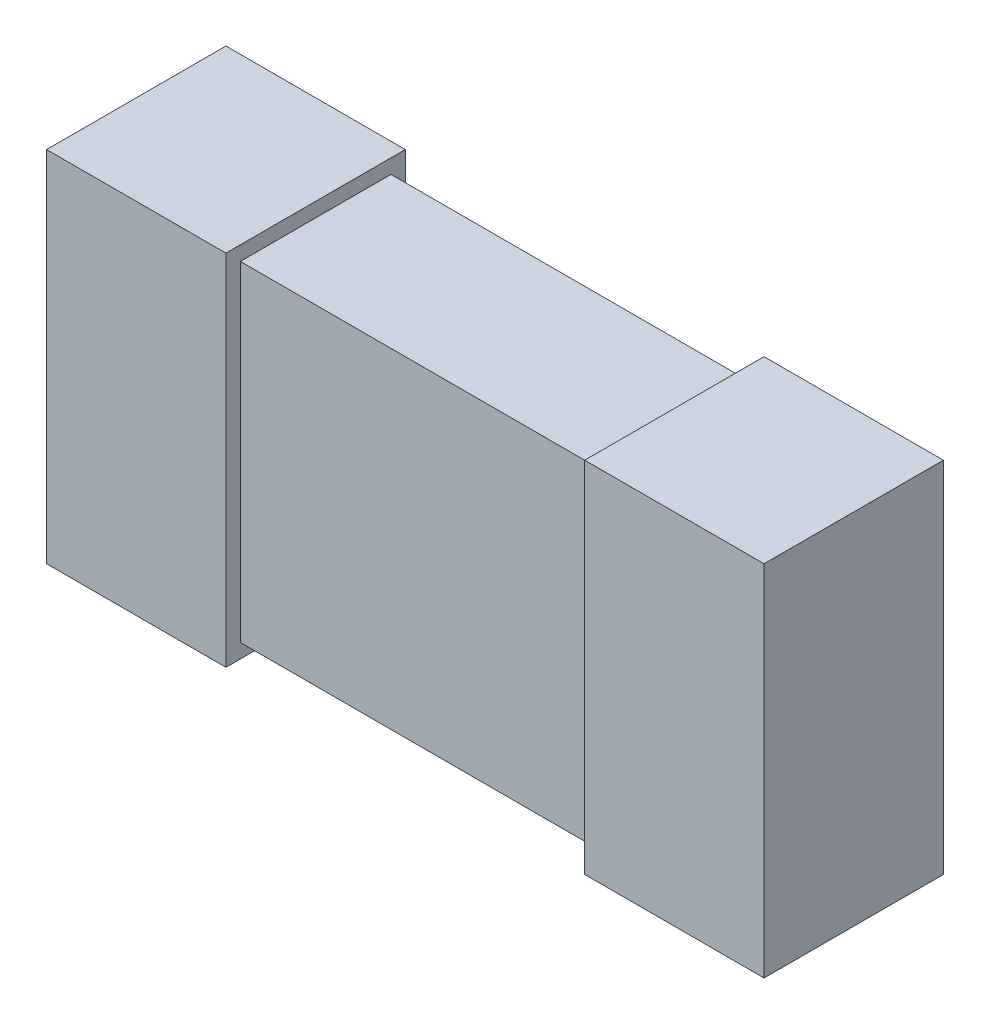
ISO-10303-21;
HEADER;
FILE_DESCRIPTION(('STEP AP214'),'2;1');
FILE_NAME('part.step','',(''),(''),'','','');
FILE_SCHEMA(('AUTOMOTIVE_DESIGN { 1 0 10303 214 1 1 1 1 }'));
ENDSEC;
DATA;
#1=APPLICATION_CONTEXT('core data for automotive mechanical design processes');
#2=APPLICATION_PROTOCOL_DEFINITION('international standard','automotive_design',2000,#1);
#3=PRODUCT_CONTEXT('',#1,'mechanical');
#4=PRODUCT('Part','Part','',(#3));
#5=PRODUCT_RELATED_PRODUCT_CATEGORY('part','',(#4));
#6=PRODUCT_DEFINITION_FORMATION('','',#4);
#7=PRODUCT_DEFINITION_CONTEXT('part definition',#1,'design');
#8=PRODUCT_DEFINITION('design','',#6,#7);
#9=PRODUCT_DEFINITION_SHAPE('','',#8);
#10=(LENGTH_UNIT() NAMED_UNIT(*) SI_UNIT(.MILLI.,.METRE.));
#11=(NAMED_UNIT(*) PLANE_ANGLE_UNIT() SI_UNIT($,.RADIAN.));
#12=(NAMED_UNIT(*) SI_UNIT($,.STERADIAN.) SOLID_ANGLE_UNIT());
#13=UNCERTAINTY_MEASURE_WITH_UNIT(LENGTH_MEASURE(1.E-05),#10,'distance_accuracy_value','');
#14=(GEOMETRIC_REPRESENTATION_CONTEXT(3) GLOBAL_UNCERTAINTY_ASSIGNED_CONTEXT((#13)) GLOBAL_UNIT_ASSIGNED_CONTEXT((#10,
#11,#12)) REPRESENTATION_CONTEXT('',''));
#15=CARTESIAN_POINT('',(0.,0.,0.));
#16=DIRECTION('',(0.,0.,1.));
#17=DIRECTION('',(1.,0.,0.));
#18=AXIS2_PLACEMENT_3D('',#15,#16,#17);
#19=CARTESIAN_POINT('',(-0.52,-0.26,0.));
#20=DIRECTION('',(0.,0.,1.));
#21=DIRECTION('',(1.,0.,0.));
#22=AXIS2_PLACEMENT_3D('',#19,#20,#21);
#23=PLANE('',#22);
#24=DIRECTION('',(0.,1.,0.));
#25=VECTOR('',#24,1.);
#26=CARTESIAN_POINT('',(0.5,0.,0.));
#27=LINE('',#26,#25);
#28=CARTESIAN_POINT('',(0.5,-0.25,0.));
#29=VERTEX_POINT('',#28);
#30=CARTESIAN_POINT('',(0.5,0.25,0.));
#31=VERTEX_POINT('',#30);
#32=EDGE_CURVE('E11',#29,#31,#27,.T.);
#33=ORIENTED_EDGE('',*,*,#32,.F.);
#34=DIRECTION('',(1.,0.,0.));
#35=VECTOR('',#34,1.);
#36=CARTESIAN_POINT('',(0.,-0.25,0.));
#37=LINE('',#36,#35);
#38=CARTESIAN_POINT('',(0.25,-0.25,0.));
#39=VERTEX_POINT('',#38);
#40=EDGE_CURVE('E25',#39,#29,#37,.T.);
#41=ORIENTED_EDGE('',*,*,#40,.F.);
#42=DIRECTION('',(0.,-1.,0.));
#43=VECTOR('',#42,1.);
#44=CARTESIAN_POINT('',(0.25,0.,0.));
#45=LINE('',#44,#43);
#46=CARTESIAN_POINT('',(0.25,0.25,0.));
#47=VERTEX_POINT('',#46);
#48=EDGE_CURVE('E267',#47,#39,#45,.T.);
#49=ORIENTED_EDGE('',*,*,#48,.F.);
#50=DIRECTION('',(-1.,0.,0.));
#51=VECTOR('',#50,1.);
#52=CARTESIAN_POINT('',(0.,0.25,0.));
#53=LINE('',#52,#51);
#54=EDGE_CURVE('E262',#31,#47,#53,.T.);
#55=ORIENTED_EDGE('',*,*,#54,.F.);
#56=EDGE_LOOP('',(#33,#41,#49,#55));
#57=FACE_BOUND('',#56,.T.);
#58=ADVANCED_FACE('F17',(#57),#23,.F.);
#59=CARTESIAN_POINT('',(0.52,0.25,-0.005));
#60=DIRECTION('',(0.,1.,0.));
#61=DIRECTION('',(-1.,0.,0.));
#62=AXIS2_PLACEMENT_3D('',#59,#60,#61);
#63=PLANE('',#62);
#64=DIRECTION('',(0.,0.,1.));
#65=VECTOR('',#64,1.);
#66=CARTESIAN_POINT('',(0.5,0.25,0.125));
#67=LINE('',#66,#65);
#68=CARTESIAN_POINT('',(0.5,0.25,0.25));
#69=VERTEX_POINT('',#68);
#70=EDGE_CURVE('E257',#31,#69,#67,.T.);
#71=ORIENTED_EDGE('',*,*,#70,.F.);
#72=ORIENTED_EDGE('',*,*,#54,.T.);
#73=DIRECTION('',(0.,0.,-1.));
#74=VECTOR('',#73,1.);
#75=CARTESIAN_POINT('',(0.25,0.25,0.125));
#76=LINE('',#75,#74);
#77=CARTESIAN_POINT('',(0.25,0.25,0.25));
#78=VERTEX_POINT('',#77);
#79=EDGE_CURVE('E252',#78,#47,#76,.T.);
#80=ORIENTED_EDGE('',*,*,#79,.F.);
#81=DIRECTION('',(-1.,0.,0.));
#82=VECTOR('',#81,1.);
#83=CARTESIAN_POINT('',(0.,0.25,0.25));
#84=LINE('',#83,#82);
#85=EDGE_CURVE('E247',#69,#78,#84,.T.);
#86=ORIENTED_EDGE('',*,*,#85,.F.);
#87=EDGE_LOOP('',(#71,#72,#80,#86));
#88=FACE_BOUND('',#87,.T.);
#89=ADVANCED_FACE('F285',(#88),#63,.T.);
#90=CARTESIAN_POINT('',(-0.52,-0.26,0.25));
#91=DIRECTION('',(0.,0.,1.));
#92=DIRECTION('',(1.,0.,0.));
#93=AXIS2_PLACEMENT_3D('',#90,#91,#92);
#94=PLANE('',#93);
#95=DIRECTION('',(0.,1.,0.));
#96=VECTOR('',#95,1.);
#97=CARTESIAN_POINT('',(0.5,0.,0.25));
#98=LINE('',#97,#96);
#99=CARTESIAN_POINT('',(0.5,-0.25,0.25));
#100=VERTEX_POINT('',#99);
#101=EDGE_CURVE('E242',#100,#69,#98,.T.);
#102=ORIENTED_EDGE('',*,*,#101,.T.);
#103=ORIENTED_EDGE('',*,*,#85,.T.);
#104=DIRECTION('',(0.,-1.,0.));
#105=VECTOR('',#104,1.);
#106=CARTESIAN_POINT('',(0.25,0.,0.25));
#107=LINE('',#106,#105);
#108=CARTESIAN_POINT('',(0.25,-0.25,0.25));
#109=VERTEX_POINT('',#108);
#110=EDGE_CURVE('E238',#78,#109,#107,.T.);
#111=ORIENTED_EDGE('',*,*,#110,.T.);
#112=DIRECTION('',(1.,0.,0.));
#113=VECTOR('',#112,1.);
#114=CARTESIAN_POINT('',(0.,-0.25,0.25));
#115=LINE('',#114,#113);
#116=EDGE_CURVE('E234',#109,#100,#115,.T.);
#117=ORIENTED_EDGE('',*,*,#116,.T.);
#118=EDGE_LOOP('',(#102,#103,#111,#117));
#119=FACE_BOUND('',#118,.T.);
#120=ADVANCED_FACE('F289',(#119),#94,.T.);
#121=CARTESIAN_POINT('',(-0.52,-0.25,-0.005));
#122=DIRECTION('',(0.,-1.,0.));
#123=DIRECTION('',(1.,0.,0.));
#124=AXIS2_PLACEMENT_3D('',#121,#122,#123);
#125=PLANE('',#124);
#126=DIRECTION('',(0.,0.,1.));
#127=VECTOR('',#126,1.);
#128=CARTESIAN_POINT('',(0.5,-0.25,0.125));
#129=LINE('',#128,#127);
#130=EDGE_CURVE('E229',#29,#100,#129,.T.);
#131=ORIENTED_EDGE('',*,*,#130,.T.);
#132=ORIENTED_EDGE('',*,*,#116,.F.);
#133=DIRECTION('',(0.,0.,1.));
#134=VECTOR('',#133,1.);
#135=CARTESIAN_POINT('',(0.25,-0.25,0.125));
#136=LINE('',#135,#134);
#137=EDGE_CURVE('E224',#39,#109,#136,.T.);
#138=ORIENTED_EDGE('',*,*,#137,.F.);
#139=ORIENTED_EDGE('',*,*,#40,.T.);
#140=EDGE_LOOP('',(#131,#132,#138,#139));
#141=FACE_BOUND('',#140,.T.);
#142=ADVANCED_FACE('F277',(#141),#125,.T.);
#143=CARTESIAN_POINT('',(0.25,-0.26,0.255));
#144=DIRECTION('',(1.,0.,0.));
#145=DIRECTION('',(0.,0.,-1.));
#146=AXIS2_PLACEMENT_3D('',#143,#144,#145);
#147=PLANE('',#146);
#148=DIRECTION('',(0.,0.,-1.));
#149=VECTOR('',#148,1.);
#150=CARTESIAN_POINT('',(0.25,0.23,0.125));
#151=LINE('',#150,#149);
#152=CARTESIAN_POINT('',(0.25,0.23,0.23));
#153=VERTEX_POINT('',#152);
#154=CARTESIAN_POINT('',(0.25,0.23,0.02));
#155=VERTEX_POINT('',#154);
#156=EDGE_CURVE('E219',#153,#155,#151,.T.);
#157=ORIENTED_EDGE('',*,*,#156,.F.);
#158=DIRECTION('',(0.,1.,0.));
#159=VECTOR('',#158,1.);
#160=CARTESIAN_POINT('',(0.25,0.,0.23));
#161=LINE('',#160,#159);
#162=CARTESIAN_POINT('',(0.25,-0.23,0.23));
#163=VERTEX_POINT('',#162);
#164=EDGE_CURVE('E214',#163,#153,#161,.T.);
#165=ORIENTED_EDGE('',*,*,#164,.F.);
#166=DIRECTION('',(0.,0.,1.));
#167=VECTOR('',#166,1.);
#168=CARTESIAN_POINT('',(0.25,-0.23,0.125));
#169=LINE('',#168,#167);
#170=CARTESIAN_POINT('',(0.25,-0.23,0.02));
#171=VERTEX_POINT('',#170);
#172=EDGE_CURVE('E209',#171,#163,#169,.T.);
#173=ORIENTED_EDGE('',*,*,#172,.F.);
#174=DIRECTION('',(0.,-1.,0.));
#175=VECTOR('',#174,1.);
#176=CARTESIAN_POINT('',(0.25,0.,0.02));
#177=LINE('',#176,#175);
#178=EDGE_CURVE('E204',#155,#171,#177,.T.);
#179=ORIENTED_EDGE('',*,*,#178,.F.);
#180=EDGE_LOOP('',(#157,#165,#173,#179));
#181=FACE_BOUND('',#180,.T.);
#182=ORIENTED_EDGE('',*,*,#110,.F.);
#183=ORIENTED_EDGE('',*,*,#79,.T.);
#184=ORIENTED_EDGE('',*,*,#48,.T.);
#185=ORIENTED_EDGE('',*,*,#137,.T.);
#186=EDGE_LOOP('',(#182,#183,#184,#185));
#187=FACE_BOUND('',#186,.T.);
#188=ADVANCED_FACE('F282',(#181,#187),#147,.F.);
#189=CARTESIAN_POINT('',(-0.26,0.2392,0.02));
#190=DIRECTION('',(0.,0.,1.));
#191=DIRECTION('',(0.,-1.,0.));
#192=AXIS2_PLACEMENT_3D('',#189,#190,#191);
#193=PLANE('',#192);
#194=DIRECTION('',(0.,-1.,0.));
#195=VECTOR('',#194,1.);
#196=CARTESIAN_POINT('',(-0.25,0.,0.02));
#197=LINE('',#196,#195);
#198=CARTESIAN_POINT('',(-0.25,0.23,0.02));
#199=VERTEX_POINT('',#198);
#200=CARTESIAN_POINT('',(-0.25,-0.23,0.02));
#201=VERTEX_POINT('',#200);
#202=EDGE_CURVE('E199',#199,#201,#197,.T.);
#203=ORIENTED_EDGE('',*,*,#202,.F.);
#204=DIRECTION('',(-1.,0.,0.));
#205=VECTOR('',#204,1.);
#206=CARTESIAN_POINT('',(0.,0.23,0.02));
#207=LINE('',#206,#205);
#208=EDGE_CURVE('E194',#155,#199,#207,.T.);
#209=ORIENTED_EDGE('',*,*,#208,.F.);
#210=ORIENTED_EDGE('',*,*,#178,.T.);
#211=DIRECTION('',(1.,0.,0.));
#212=VECTOR('',#211,1.);
#213=CARTESIAN_POINT('',(0.,-0.23,0.02));
#214=LINE('',#213,#212);
#215=EDGE_CURVE('E189',#201,#171,#214,.T.);
#216=ORIENTED_EDGE('',*,*,#215,.F.);
#217=EDGE_LOOP('',(#203,#209,#210,#216));
#218=FACE_BOUND('',#217,.T.);
#219=ADVANCED_FACE('F332',(#218),#193,.F.);
#220=CARTESIAN_POINT('',(-0.26,-0.23,0.0158));
#221=DIRECTION('',(0.,1.,0.));
#222=DIRECTION('',(0.,0.,1.));
#223=AXIS2_PLACEMENT_3D('',#220,#221,#222);
#224=PLANE('',#223);
#225=DIRECTION('',(0.,0.,1.));
#226=VECTOR('',#225,1.);
#227=CARTESIAN_POINT('',(-0.25,-0.23,0.125));
#228=LINE('',#227,#226);
#229=CARTESIAN_POINT('',(-0.25,-0.23,0.23));
#230=VERTEX_POINT('',#229);
#231=EDGE_CURVE('E184',#201,#230,#228,.T.);
#232=ORIENTED_EDGE('',*,*,#231,.F.);
#233=ORIENTED_EDGE('',*,*,#215,.T.);
#234=ORIENTED_EDGE('',*,*,#172,.T.);
#235=DIRECTION('',(-1.,0.,0.));
#236=VECTOR('',#235,1.);
#237=CARTESIAN_POINT('',(0.,-0.23,0.23));
#238=LINE('',#237,#236);
#239=EDGE_CURVE('E180',#163,#230,#238,.T.);
#240=ORIENTED_EDGE('',*,*,#239,.T.);
#241=EDGE_LOOP('',(#232,#233,#234,#240));
#242=FACE_BOUND('',#241,.T.);
#243=ADVANCED_FACE('F343',(#242),#224,.F.);
#244=CARTESIAN_POINT('',(-0.26,-0.2392,0.23));
#245=DIRECTION('',(0.,0.,-1.));
#246=DIRECTION('',(0.,1.,0.));
#247=AXIS2_PLACEMENT_3D('',#244,#245,#246);
#248=PLANE('',#247);
#249=DIRECTION('',(0.,1.,0.));
#250=VECTOR('',#249,1.);
#251=CARTESIAN_POINT('',(-0.25,0.,0.23));
#252=LINE('',#251,#250);
#253=CARTESIAN_POINT('',(-0.25,0.23,0.23));
#254=VERTEX_POINT('',#253);
#255=EDGE_CURVE('E175',#230,#254,#252,.T.);
#256=ORIENTED_EDGE('',*,*,#255,.F.);
#257=ORIENTED_EDGE('',*,*,#239,.F.);
#258=ORIENTED_EDGE('',*,*,#164,.T.);
#259=DIRECTION('',(-1.,0.,0.));
#260=VECTOR('',#259,1.);
#261=CARTESIAN_POINT('',(0.,0.23,0.23));
#262=LINE('',#261,#260);
#263=EDGE_CURVE('E171',#153,#254,#262,.T.);
#264=ORIENTED_EDGE('',*,*,#263,.T.);
#265=EDGE_LOOP('',(#256,#257,#258,#264));
#266=FACE_BOUND('',#265,.T.);
#267=ADVANCED_FACE('F355',(#266),#248,.F.);
#268=CARTESIAN_POINT('',(-0.26,0.23,0.2342));
#269=DIRECTION('',(0.,-1.,0.));
#270=DIRECTION('',(0.,0.,-1.));
#271=AXIS2_PLACEMENT_3D('',#268,#269,#270);
#272=PLANE('',#271);
#273=DIRECTION('',(0.,0.,-1.));
#274=VECTOR('',#273,1.);
#275=CARTESIAN_POINT('',(-0.25,0.23,0.125));
#276=LINE('',#275,#274);
#277=EDGE_CURVE('E166',#254,#199,#276,.T.);
#278=ORIENTED_EDGE('',*,*,#277,.F.);
#279=ORIENTED_EDGE('',*,*,#263,.F.);
#280=ORIENTED_EDGE('',*,*,#156,.T.);
#281=ORIENTED_EDGE('',*,*,#208,.T.);
#282=EDGE_LOOP('',(#278,#279,#280,#281));
#283=FACE_BOUND('',#282,.T.);
#284=ADVANCED_FACE('F367',(#283),#272,.F.);
#285=CARTESIAN_POINT('',(-0.25,-0.26,0.255));
#286=DIRECTION('',(1.,0.,0.));
#287=DIRECTION('',(0.,0.,-1.));
#288=AXIS2_PLACEMENT_3D('',#285,#286,#287);
#289=PLANE('',#288);
#290=ORIENTED_EDGE('',*,*,#277,.T.);
#291=ORIENTED_EDGE('',*,*,#202,.T.);
#292=ORIENTED_EDGE('',*,*,#231,.T.);
#293=ORIENTED_EDGE('',*,*,#255,.T.);
#294=EDGE_LOOP('',(#290,#291,#292,#293));
#295=FACE_BOUND('',#294,.T.);
#296=DIRECTION('',(0.,1.,0.));
#297=VECTOR('',#296,1.);
#298=CARTESIAN_POINT('',(-0.25,0.,0.25));
#299=LINE('',#298,#297);
#300=CARTESIAN_POINT('',(-0.25,-0.25,0.25));
#301=VERTEX_POINT('',#300);
#302=CARTESIAN_POINT('',(-0.25,0.25,0.25));
#303=VERTEX_POINT('',#302);
#304=EDGE_CURVE('E162',#301,#303,#299,.T.);
#305=ORIENTED_EDGE('',*,*,#304,.F.);
#306=DIRECTION('',(0.,0.,1.));
#307=VECTOR('',#306,1.);
#308=CARTESIAN_POINT('',(-0.25,-0.25,0.125));
#309=LINE('',#308,#307);
#310=CARTESIAN_POINT('',(-0.25,-0.25,0.));
#311=VERTEX_POINT('',#310);
#312=EDGE_CURVE('E110',#311,#301,#309,.T.);
#313=ORIENTED_EDGE('',*,*,#312,.F.);
#314=DIRECTION('',(0.,-1.,0.));
#315=VECTOR('',#314,1.);
#316=CARTESIAN_POINT('',(-0.25,0.,0.));
#317=LINE('',#316,#315);
#318=CARTESIAN_POINT('',(-0.25,0.25,0.));
#319=VERTEX_POINT('',#318);
#320=EDGE_CURVE('E154',#319,#311,#317,.T.);
#321=ORIENTED_EDGE('',*,*,#320,.F.);
#322=DIRECTION('',(0.,0.,-1.));
#323=VECTOR('',#322,1.);
#324=CARTESIAN_POINT('',(-0.25,0.25,0.125));
#325=LINE('',#324,#323);
#326=EDGE_CURVE('E149',#303,#319,#325,.T.);
#327=ORIENTED_EDGE('',*,*,#326,.F.);
#328=EDGE_LOOP('',(#305,#313,#321,#327));
#329=FACE_BOUND('',#328,.T.);
#330=ADVANCED_FACE('F379',(#295,#329),#289,.T.);
#331=CARTESIAN_POINT('',(0.52,0.25,-0.005));
#332=DIRECTION('',(0.,1.,0.));
#333=DIRECTION('',(-1.,0.,0.));
#334=AXIS2_PLACEMENT_3D('',#331,#332,#333);
#335=PLANE('',#334);
#336=DIRECTION('',(0.,0.,-1.));
#337=VECTOR('',#336,1.);
#338=CARTESIAN_POINT('',(-0.5,0.25,0.125));
#339=LINE('',#338,#337);
#340=CARTESIAN_POINT('',(-0.5,0.25,0.25));
#341=VERTEX_POINT('',#340);
#342=CARTESIAN_POINT('',(-0.5,0.25,0.));
#343=VERTEX_POINT('',#342);
#344=EDGE_CURVE('E145',#341,#343,#339,.T.);
#345=ORIENTED_EDGE('',*,*,#344,.F.);
#346=DIRECTION('',(-1.,0.,0.));
#347=VECTOR('',#346,1.);
#348=CARTESIAN_POINT('',(0.,0.25,0.25));
#349=LINE('',#348,#347);
#350=EDGE_CURVE('E119',#303,#341,#349,.T.);
#351=ORIENTED_EDGE('',*,*,#350,.F.);
#352=ORIENTED_EDGE('',*,*,#326,.T.);
#353=DIRECTION('',(1.,0.,0.));
#354=VECTOR('',#353,1.);
#355=CARTESIAN_POINT('',(0.,0.25,0.));
#356=LINE('',#355,#354);
#357=EDGE_CURVE('E137',#343,#319,#356,.T.);
#358=ORIENTED_EDGE('',*,*,#357,.F.);
#359=EDGE_LOOP('',(#345,#351,#352,#358));
#360=FACE_BOUND('',#359,.T.);
#361=ADVANCED_FACE('F390',(#360),#335,.T.);
#362=CARTESIAN_POINT('',(-0.52,-0.26,0.));
#363=DIRECTION('',(0.,0.,1.));
#364=DIRECTION('',(1.,0.,0.));
#365=AXIS2_PLACEMENT_3D('',#362,#363,#364);
#366=PLANE('',#365);
#367=DIRECTION('',(0.,-1.,0.));
#368=VECTOR('',#367,1.);
#369=CARTESIAN_POINT('',(-0.5,0.,0.));
#370=LINE('',#369,#368);
#371=CARTESIAN_POINT('',(-0.5,-0.25,0.));
#372=VERTEX_POINT('',#371);
#373=EDGE_CURVE('E125',#343,#372,#370,.T.);
#374=ORIENTED_EDGE('',*,*,#373,.F.);
#375=ORIENTED_EDGE('',*,*,#357,.T.);
#376=ORIENTED_EDGE('',*,*,#320,.T.);
#377=DIRECTION('',(-1.,0.,0.));
#378=VECTOR('',#377,1.);
#379=CARTESIAN_POINT('',(0.,-0.25,0.));
#380=LINE('',#379,#378);
#381=EDGE_CURVE('E126',#311,#372,#380,.T.);
#382=ORIENTED_EDGE('',*,*,#381,.T.);
#383=EDGE_LOOP('',(#374,#375,#376,#382));
#384=FACE_BOUND('',#383,.T.);
#385=ADVANCED_FACE('F400',(#384),#366,.F.);
#386=CARTESIAN_POINT('',(-0.52,-0.25,-0.005));
#387=DIRECTION('',(0.,-1.,0.));
#388=DIRECTION('',(1.,0.,0.));
#389=AXIS2_PLACEMENT_3D('',#386,#387,#388);
#390=PLANE('',#389);
#391=DIRECTION('',(0.,0.,1.));
#392=VECTOR('',#391,1.);
#393=CARTESIAN_POINT('',(-0.5,-0.25,0.125));
#394=LINE('',#393,#392);
#395=CARTESIAN_POINT('',(-0.5,-0.25,0.25));
#396=VERTEX_POINT('',#395);
#397=EDGE_CURVE('E108',#372,#396,#394,.T.);
#398=ORIENTED_EDGE('',*,*,#397,.F.);
#399=ORIENTED_EDGE('',*,*,#381,.F.);
#400=ORIENTED_EDGE('',*,*,#312,.T.);
#401=DIRECTION('',(-1.,0.,0.));
#402=VECTOR('',#401,1.);
#403=CARTESIAN_POINT('',(0.,-0.25,0.25));
#404=LINE('',#403,#402);
#405=EDGE_CURVE('E103',#301,#396,#404,.T.);
#406=ORIENTED_EDGE('',*,*,#405,.T.);
#407=EDGE_LOOP('',(#398,#399,#400,#406));
#408=FACE_BOUND('',#407,.T.);
#409=ADVANCED_FACE('F105',(#408),#390,.T.);
#410=CARTESIAN_POINT('',(-0.52,-0.26,0.25));
#411=DIRECTION('',(0.,0.,1.));
#412=DIRECTION('',(1.,0.,0.));
#413=AXIS2_PLACEMENT_3D('',#410,#411,#412);
#414=PLANE('',#413);
#415=DIRECTION('',(0.,1.,0.));
#416=VECTOR('',#415,1.);
#417=CARTESIAN_POINT('',(-0.5,0.,0.25));
#418=LINE('',#417,#416);
#419=EDGE_CURVE('E113',#396,#341,#418,.T.);
#420=ORIENTED_EDGE('',*,*,#419,.F.);
#421=ORIENTED_EDGE('',*,*,#405,.F.);
#422=ORIENTED_EDGE('',*,*,#304,.T.);
#423=ORIENTED_EDGE('',*,*,#350,.T.);
#424=EDGE_LOOP('',(#420,#421,#422,#423));
#425=FACE_BOUND('',#424,.T.);
#426=ADVANCED_FACE('F117',(#425),#414,.T.);
#427=CARTESIAN_POINT('',(-0.5,0.26,-0.005));
#428=DIRECTION('',(-1.,0.,0.));
#429=DIRECTION('',(0.,-1.,0.));
#430=AXIS2_PLACEMENT_3D('',#427,#428,#429);
#431=PLANE('',#430);
#432=ORIENTED_EDGE('',*,*,#419,.T.);
#433=ORIENTED_EDGE('',*,*,#344,.T.);
#434=ORIENTED_EDGE('',*,*,#373,.T.);
#435=ORIENTED_EDGE('',*,*,#397,.T.);
#436=EDGE_LOOP('',(#432,#433,#434,#435));
#437=FACE_BOUND('',#436,.T.);
#438=ADVANCED_FACE('F123',(#437),#431,.T.);
#439=CARTESIAN_POINT('',(0.5,-0.26,-0.005));
#440=DIRECTION('',(1.,0.,0.));
#441=DIRECTION('',(0.,1.,0.));
#442=AXIS2_PLACEMENT_3D('',#439,#440,#441);
#443=PLANE('',#442);
#444=ORIENTED_EDGE('',*,*,#101,.F.);
#445=ORIENTED_EDGE('',*,*,#130,.F.);
#446=ORIENTED_EDGE('',*,*,#32,.T.);
#447=ORIENTED_EDGE('',*,*,#70,.T.);
#448=EDGE_LOOP('',(#444,#445,#446,#447));
#449=FACE_BOUND('',#448,.T.);
#450=ADVANCED_FACE('F287',(#449),#443,.T.);
#451=CLOSED_SHELL('',(#58,#89,#120,#142,#188,#219,#243,#267,#284,#330,#361,#385,#409,#426,#438,#450));
#452=MANIFOLD_SOLID_BREP('B1',#451);
#453=ADVANCED_BREP_SHAPE_REPRESENTATION('',(#18,#452),#14);
#454=SHAPE_DEFINITION_REPRESENTATION(#9,#453);
ENDSEC;
END-ISO-10303-21;
